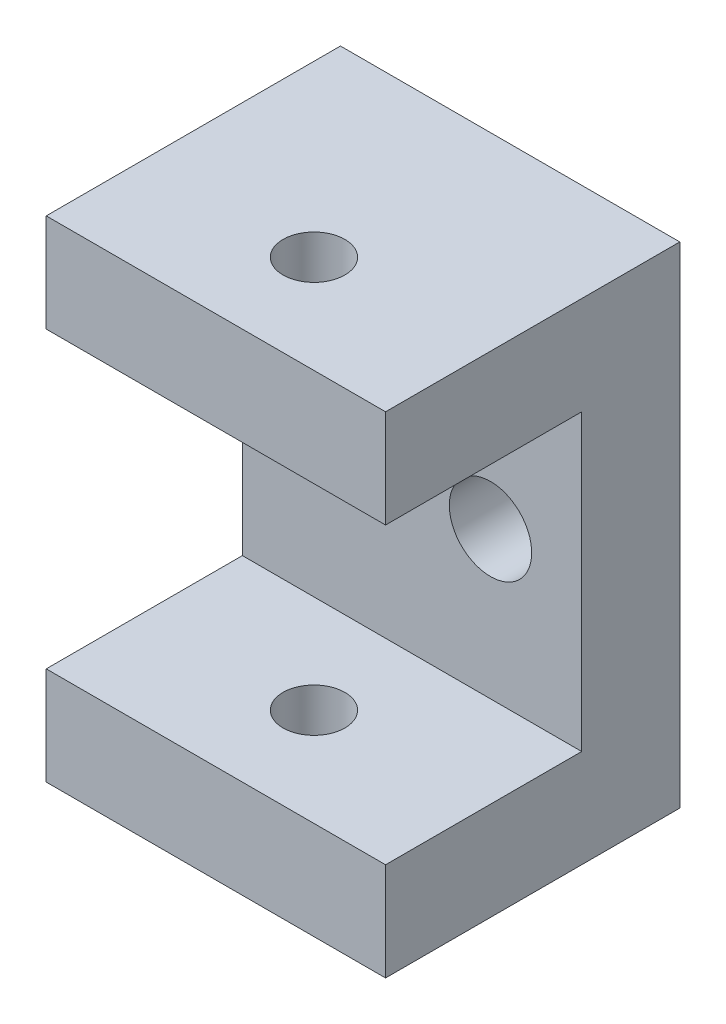
ISO-10303-21;
HEADER;
FILE_DESCRIPTION(('STEP AP214'),'2;1');
FILE_NAME('part.step','',(''),(''),'','','');
FILE_SCHEMA(('AUTOMOTIVE_DESIGN { 1 0 10303 214 1 1 1 1 }'));
ENDSEC;
DATA;
#1=APPLICATION_CONTEXT('core data for automotive mechanical design processes');
#2=APPLICATION_PROTOCOL_DEFINITION('international standard','automotive_design',2000,#1);
#3=PRODUCT_CONTEXT('',#1,'mechanical');
#4=PRODUCT('Part','Part','',(#3));
#5=PRODUCT_RELATED_PRODUCT_CATEGORY('part','',(#4));
#6=PRODUCT_DEFINITION_FORMATION('','',#4);
#7=PRODUCT_DEFINITION_CONTEXT('part definition',#1,'design');
#8=PRODUCT_DEFINITION('design','',#6,#7);
#9=PRODUCT_DEFINITION_SHAPE('','',#8);
#10=(LENGTH_UNIT() NAMED_UNIT(*) SI_UNIT(.MILLI.,.METRE.));
#11=(NAMED_UNIT(*) PLANE_ANGLE_UNIT() SI_UNIT($,.RADIAN.));
#12=(NAMED_UNIT(*) SI_UNIT($,.STERADIAN.) SOLID_ANGLE_UNIT());
#13=UNCERTAINTY_MEASURE_WITH_UNIT(LENGTH_MEASURE(1.E-05),#10,'distance_accuracy_value','');
#14=(GEOMETRIC_REPRESENTATION_CONTEXT(3) GLOBAL_UNCERTAINTY_ASSIGNED_CONTEXT((#13)) GLOBAL_UNIT_ASSIGNED_CONTEXT((#10,
#11,#12)) REPRESENTATION_CONTEXT('',''));
#15=CARTESIAN_POINT('',(0.,0.,0.));
#16=DIRECTION('',(0.,0.,1.));
#17=DIRECTION('',(1.,0.,0.));
#18=AXIS2_PLACEMENT_3D('',#15,#16,#17);
#19=CARTESIAN_POINT('',(0.,0.,30.));
#20=DIRECTION('',(0.,0.,1.));
#21=DIRECTION('',(1.,0.,0.));
#22=AXIS2_PLACEMENT_3D('',#19,#20,#21);
#23=PLANE('',#22);
#24=DIRECTION('',(-1.,0.,0.));
#25=VECTOR('',#24,1.);
#26=CARTESIAN_POINT('',(17.3,-15.,30.));
#27=LINE('',#26,#25);
#28=CARTESIAN_POINT('',(17.3,-15.,30.));
#29=VERTEX_POINT('',#28);
#30=CARTESIAN_POINT('',(-17.3,-15.,30.));
#31=VERTEX_POINT('',#30);
#32=EDGE_CURVE('E156',#29,#31,#27,.T.);
#33=ORIENTED_EDGE('',*,*,#32,.T.);
#34=DIRECTION('',(0.,-1.,0.));
#35=VECTOR('',#34,1.);
#36=CARTESIAN_POINT('',(-17.3,-25.,30.));
#37=LINE('',#36,#35);
#38=CARTESIAN_POINT('',(-17.3,-25.,30.));
#39=VERTEX_POINT('',#38);
#40=EDGE_CURVE('E90',#31,#39,#37,.T.);
#41=ORIENTED_EDGE('',*,*,#40,.T.);
#42=DIRECTION('',(1.,0.,0.));
#43=VECTOR('',#42,1.);
#44=CARTESIAN_POINT('',(17.3,-25.,30.));
#45=LINE('',#44,#43);
#46=CARTESIAN_POINT('',(17.3,-25.,30.));
#47=VERTEX_POINT('',#46);
#48=EDGE_CURVE('E133',#39,#47,#45,.T.);
#49=ORIENTED_EDGE('',*,*,#48,.T.);
#50=DIRECTION('',(0.,1.,0.));
#51=VECTOR('',#50,1.);
#52=CARTESIAN_POINT('',(17.3,-25.,30.));
#53=LINE('',#52,#51);
#54=EDGE_CURVE('E132',#47,#29,#53,.T.);
#55=ORIENTED_EDGE('',*,*,#54,.T.);
#56=EDGE_LOOP('',(#33,#41,#49,#55));
#57=FACE_BOUND('',#56,.T.);
#58=ADVANCED_FACE('F35',(#57),#23,.T.);
#59=DIRECTION('',(-1.,0.,0.));
#60=VECTOR('',#59,1.);
#61=CARTESIAN_POINT('',(17.3,15.,30.));
#62=LINE('',#61,#60);
#63=CARTESIAN_POINT('',(17.3,15.,30.));
#64=VERTEX_POINT('',#63);
#65=CARTESIAN_POINT('',(-17.3,15.,30.));
#66=VERTEX_POINT('',#65);
#67=EDGE_CURVE('E116',#64,#66,#62,.T.);
#68=ORIENTED_EDGE('',*,*,#67,.F.);
#69=CARTESIAN_POINT('',(17.3,25.,30.));
#70=VERTEX_POINT('',#69);
#71=EDGE_CURVE('E124',#64,#70,#53,.T.);
#72=ORIENTED_EDGE('',*,*,#71,.T.);
#73=DIRECTION('',(-1.,0.,0.));
#74=VECTOR('',#73,1.);
#75=CARTESIAN_POINT('',(17.3,25.,30.));
#76=LINE('',#75,#74);
#77=CARTESIAN_POINT('',(-17.3,25.,30.));
#78=VERTEX_POINT('',#77);
#79=EDGE_CURVE('E61',#70,#78,#76,.T.);
#80=ORIENTED_EDGE('',*,*,#79,.T.);
#81=EDGE_CURVE('E127',#78,#66,#37,.T.);
#82=ORIENTED_EDGE('',*,*,#81,.T.);
#83=EDGE_LOOP('',(#68,#72,#80,#82));
#84=FACE_BOUND('',#83,.T.);
#85=ADVANCED_FACE('F123',(#84),#23,.T.);
#86=CARTESIAN_POINT('',(0.,0.,0.));
#87=DIRECTION('',(0.,0.,1.));
#88=DIRECTION('',(1.,0.,0.));
#89=AXIS2_PLACEMENT_3D('',#86,#87,#88);
#90=PLANE('',#89);
#91=DIRECTION('',(0.,-1.,0.));
#92=VECTOR('',#91,1.);
#93=CARTESIAN_POINT('',(-17.3,-25.,0.));
#94=LINE('',#93,#92);
#95=CARTESIAN_POINT('',(-17.3,25.,0.));
#96=VERTEX_POINT('',#95);
#97=CARTESIAN_POINT('',(-17.3,-25.,0.));
#98=VERTEX_POINT('',#97);
#99=EDGE_CURVE('E141',#96,#98,#94,.T.);
#100=ORIENTED_EDGE('',*,*,#99,.F.);
#101=DIRECTION('',(-1.,0.,0.));
#102=VECTOR('',#101,1.);
#103=CARTESIAN_POINT('',(17.3,25.,0.));
#104=LINE('',#103,#102);
#105=CARTESIAN_POINT('',(17.3,25.,0.));
#106=VERTEX_POINT('',#105);
#107=EDGE_CURVE('E82',#106,#96,#104,.T.);
#108=ORIENTED_EDGE('',*,*,#107,.F.);
#109=DIRECTION('',(0.,1.,0.));
#110=VECTOR('',#109,1.);
#111=CARTESIAN_POINT('',(17.3,-25.,0.));
#112=LINE('',#111,#110);
#113=CARTESIAN_POINT('',(17.3,-25.,0.));
#114=VERTEX_POINT('',#113);
#115=EDGE_CURVE('E147',#114,#106,#112,.T.);
#116=ORIENTED_EDGE('',*,*,#115,.F.);
#117=DIRECTION('',(1.,0.,0.));
#118=VECTOR('',#117,1.);
#119=CARTESIAN_POINT('',(17.3,-25.,0.));
#120=LINE('',#119,#118);
#121=EDGE_CURVE('E144',#98,#114,#120,.T.);
#122=ORIENTED_EDGE('',*,*,#121,.F.);
#123=EDGE_LOOP('',(#100,#108,#116,#122));
#124=FACE_BOUND('',#123,.T.);
#125=CARTESIAN_POINT('',(-8.,0.,0.));
#126=DIRECTION('',(0.,0.,1.));
#127=DIRECTION('',(1.,0.,0.));
#128=AXIS2_PLACEMENT_3D('',#125,#126,#127);
#129=CIRCLE('',#128,4.2);
#130=CARTESIAN_POINT('',(-3.8,0.,0.));
#131=VERTEX_POINT('',#130);
#132=EDGE_CURVE('E145',#131,#131,#129,.T.);
#133=ORIENTED_EDGE('',*,*,#132,.T.);
#134=EDGE_LOOP('',(#133));
#135=FACE_BOUND('',#134,.T.);
#136=CARTESIAN_POINT('',(8.,0.,0.));
#137=DIRECTION('',(0.,0.,1.));
#138=DIRECTION('',(1.,0.,0.));
#139=AXIS2_PLACEMENT_3D('',#136,#137,#138);
#140=CIRCLE('',#139,4.2);
#141=CARTESIAN_POINT('',(12.2,0.,0.));
#142=VERTEX_POINT('',#141);
#143=EDGE_CURVE('E160',#142,#142,#140,.T.);
#144=ORIENTED_EDGE('',*,*,#143,.T.);
#145=EDGE_LOOP('',(#144));
#146=FACE_BOUND('',#145,.T.);
#147=ADVANCED_FACE('F174',(#124,#135,#146),#90,.F.);
#148=CARTESIAN_POINT('',(-17.3,-25.,30.));
#149=DIRECTION('',(1.,0.,0.));
#150=DIRECTION('',(0.,1.,0.));
#151=AXIS2_PLACEMENT_3D('',#148,#149,#150);
#152=PLANE('',#151);
#153=ORIENTED_EDGE('',*,*,#40,.F.);
#154=DIRECTION('',(0.,0.,1.));
#155=VECTOR('',#154,1.);
#156=CARTESIAN_POINT('',(-17.3,-15.,10.));
#157=LINE('',#156,#155);
#158=CARTESIAN_POINT('',(-17.3,-15.,10.));
#159=VERTEX_POINT('',#158);
#160=EDGE_CURVE('E121',#159,#31,#157,.T.);
#161=ORIENTED_EDGE('',*,*,#160,.F.);
#162=DIRECTION('',(0.,-1.,0.));
#163=VECTOR('',#162,1.);
#164=CARTESIAN_POINT('',(-17.3,15.,10.));
#165=LINE('',#164,#163);
#166=CARTESIAN_POINT('',(-17.3,15.,10.));
#167=VERTEX_POINT('',#166);
#168=EDGE_CURVE('E224',#167,#159,#165,.T.);
#169=ORIENTED_EDGE('',*,*,#168,.F.);
#170=DIRECTION('',(0.,0.,-1.));
#171=VECTOR('',#170,1.);
#172=CARTESIAN_POINT('',(-17.3,15.,10.));
#173=LINE('',#172,#171);
#174=EDGE_CURVE('E221',#66,#167,#173,.T.);
#175=ORIENTED_EDGE('',*,*,#174,.F.);
#176=ORIENTED_EDGE('',*,*,#81,.F.);
#177=DIRECTION('',(0.,0.,-1.));
#178=VECTOR('',#177,1.);
#179=CARTESIAN_POINT('',(-17.3,25.,30.));
#180=LINE('',#179,#178);
#181=EDGE_CURVE('E140',#78,#96,#180,.T.);
#182=ORIENTED_EDGE('',*,*,#181,.T.);
#183=ORIENTED_EDGE('',*,*,#99,.T.);
#184=DIRECTION('',(0.,0.,-1.));
#185=VECTOR('',#184,1.);
#186=CARTESIAN_POINT('',(-17.3,-25.,30.));
#187=LINE('',#186,#185);
#188=EDGE_CURVE('E11',#39,#98,#187,.T.);
#189=ORIENTED_EDGE('',*,*,#188,.F.);
#190=EDGE_LOOP('',(#153,#161,#169,#175,#176,#182,#183,#189));
#191=FACE_BOUND('',#190,.T.);
#192=ADVANCED_FACE('F37',(#191),#152,.F.);
#193=CARTESIAN_POINT('',(17.3,-25.,30.));
#194=DIRECTION('',(0.,1.,0.));
#195=DIRECTION('',(0.,0.,1.));
#196=AXIS2_PLACEMENT_3D('',#193,#194,#195);
#197=PLANE('',#196);
#198=CARTESIAN_POINT('',(0.,-25.,20.));
#199=DIRECTION('',(0.,1.,0.));
#200=DIRECTION('',(-1.,0.,0.));
#201=AXIS2_PLACEMENT_3D('',#198,#199,#200);
#202=CIRCLE('',#201,3.15);
#203=CARTESIAN_POINT('',(-3.15000000000001,-25.,20.));
#204=VERTEX_POINT('',#203);
#205=EDGE_CURVE('E213',#204,#204,#202,.T.);
#206=ORIENTED_EDGE('',*,*,#205,.T.);
#207=EDGE_LOOP('',(#206));
#208=FACE_BOUND('',#207,.T.);
#209=ORIENTED_EDGE('',*,*,#121,.T.);
#210=DIRECTION('',(0.,0.,-1.));
#211=VECTOR('',#210,1.);
#212=CARTESIAN_POINT('',(17.3,-25.,30.));
#213=LINE('',#212,#211);
#214=EDGE_CURVE('E44',#47,#114,#213,.T.);
#215=ORIENTED_EDGE('',*,*,#214,.F.);
#216=ORIENTED_EDGE('',*,*,#48,.F.);
#217=ORIENTED_EDGE('',*,*,#188,.T.);
#218=EDGE_LOOP('',(#209,#215,#216,#217));
#219=FACE_BOUND('',#218,.T.);
#220=ADVANCED_FACE('F203',(#208,#219),#197,.F.);
#221=CARTESIAN_POINT('',(17.3,-25.,30.));
#222=DIRECTION('',(-1.,0.,0.));
#223=DIRECTION('',(0.,0.,1.));
#224=AXIS2_PLACEMENT_3D('',#221,#222,#223);
#225=PLANE('',#224);
#226=DIRECTION('',(0.,-1.,0.));
#227=VECTOR('',#226,1.);
#228=CARTESIAN_POINT('',(17.3,15.,10.));
#229=LINE('',#228,#227);
#230=CARTESIAN_POINT('',(17.3,15.,10.));
#231=VERTEX_POINT('',#230);
#232=CARTESIAN_POINT('',(17.3,-15.,10.));
#233=VERTEX_POINT('',#232);
#234=EDGE_CURVE('E52',#231,#233,#229,.T.);
#235=ORIENTED_EDGE('',*,*,#234,.T.);
#236=DIRECTION('',(0.,0.,1.));
#237=VECTOR('',#236,1.);
#238=CARTESIAN_POINT('',(17.3,-15.,10.));
#239=LINE('',#238,#237);
#240=EDGE_CURVE('E128',#233,#29,#239,.T.);
#241=ORIENTED_EDGE('',*,*,#240,.T.);
#242=ORIENTED_EDGE('',*,*,#54,.F.);
#243=ORIENTED_EDGE('',*,*,#214,.T.);
#244=ORIENTED_EDGE('',*,*,#115,.T.);
#245=DIRECTION('',(0.,0.,-1.));
#246=VECTOR('',#245,1.);
#247=CARTESIAN_POINT('',(17.3,25.,30.));
#248=LINE('',#247,#246);
#249=EDGE_CURVE('E131',#70,#106,#248,.T.);
#250=ORIENTED_EDGE('',*,*,#249,.F.);
#251=ORIENTED_EDGE('',*,*,#71,.F.);
#252=DIRECTION('',(0.,0.,-1.));
#253=VECTOR('',#252,1.);
#254=CARTESIAN_POINT('',(17.3,15.,10.));
#255=LINE('',#254,#253);
#256=EDGE_CURVE('E112',#64,#231,#255,.T.);
#257=ORIENTED_EDGE('',*,*,#256,.T.);
#258=EDGE_LOOP('',(#235,#241,#242,#243,#244,#250,#251,#257));
#259=FACE_BOUND('',#258,.T.);
#260=ADVANCED_FACE('F130',(#259),#225,.F.);
#261=CARTESIAN_POINT('',(17.3,25.,30.));
#262=DIRECTION('',(0.,-1.,0.));
#263=DIRECTION('',(0.,0.,-1.));
#264=AXIS2_PLACEMENT_3D('',#261,#262,#263);
#265=PLANE('',#264);
#266=CARTESIAN_POINT('',(0.,25.,20.));
#267=DIRECTION('',(0.,1.,0.));
#268=DIRECTION('',(-1.,0.,0.));
#269=AXIS2_PLACEMENT_3D('',#266,#267,#268);
#270=CIRCLE('',#269,3.15);
#271=CARTESIAN_POINT('',(-3.15,25.,20.));
#272=VERTEX_POINT('',#271);
#273=EDGE_CURVE('E232',#272,#272,#270,.T.);
#274=ORIENTED_EDGE('',*,*,#273,.F.);
#275=EDGE_LOOP('',(#274));
#276=FACE_BOUND('',#275,.T.);
#277=ORIENTED_EDGE('',*,*,#107,.T.);
#278=ORIENTED_EDGE('',*,*,#181,.F.);
#279=ORIENTED_EDGE('',*,*,#79,.F.);
#280=ORIENTED_EDGE('',*,*,#249,.T.);
#281=EDGE_LOOP('',(#277,#278,#279,#280));
#282=FACE_BOUND('',#281,.T.);
#283=ADVANCED_FACE('F180',(#276,#282),#265,.F.);
#284=CARTESIAN_POINT('',(-8.,0.,30.));
#285=DIRECTION('',(0.,0.,-1.));
#286=DIRECTION('',(-1.,0.,0.));
#287=AXIS2_PLACEMENT_3D('',#284,#285,#286);
#288=CYLINDRICAL_SURFACE('',#287,4.2);
#289=CARTESIAN_POINT('',(-8.,0.,10.));
#290=DIRECTION('',(0.,0.,-1.));
#291=DIRECTION('',(-1.,0.,0.));
#292=AXIS2_PLACEMENT_3D('',#289,#290,#291);
#293=CIRCLE('',#292,4.2);
#294=CARTESIAN_POINT('',(-12.2,0.,10.));
#295=VERTEX_POINT('',#294);
#296=EDGE_CURVE('E155',#295,#295,#293,.T.);
#297=ORIENTED_EDGE('',*,*,#296,.F.);
#298=EDGE_LOOP('',(#297));
#299=FACE_BOUND('',#298,.T.);
#300=ORIENTED_EDGE('',*,*,#132,.F.);
#301=EDGE_LOOP('',(#300));
#302=FACE_BOUND('',#301,.T.);
#303=ADVANCED_FACE('F177',(#299,#302),#288,.F.);
#304=CARTESIAN_POINT('',(8.,0.,30.));
#305=DIRECTION('',(0.,0.,-1.));
#306=DIRECTION('',(-1.,0.,0.));
#307=AXIS2_PLACEMENT_3D('',#304,#305,#306);
#308=CYLINDRICAL_SURFACE('',#307,4.2);
#309=CARTESIAN_POINT('',(8.,0.,10.));
#310=DIRECTION('',(0.,0.,-1.));
#311=DIRECTION('',(-1.,0.,0.));
#312=AXIS2_PLACEMENT_3D('',#309,#310,#311);
#313=CIRCLE('',#312,4.2);
#314=CARTESIAN_POINT('',(3.8,0.,10.));
#315=VERTEX_POINT('',#314);
#316=EDGE_CURVE('E153',#315,#315,#313,.T.);
#317=ORIENTED_EDGE('',*,*,#316,.F.);
#318=EDGE_LOOP('',(#317));
#319=FACE_BOUND('',#318,.T.);
#320=ORIENTED_EDGE('',*,*,#143,.F.);
#321=EDGE_LOOP('',(#320));
#322=FACE_BOUND('',#321,.T.);
#323=ADVANCED_FACE('F179',(#319,#322),#308,.F.);
#324=CARTESIAN_POINT('',(17.3,-15.,10.));
#325=DIRECTION('',(0.,-1.,0.));
#326=DIRECTION('',(1.,0.,0.));
#327=AXIS2_PLACEMENT_3D('',#324,#325,#326);
#328=PLANE('',#327);
#329=CARTESIAN_POINT('',(0.,-15.,20.));
#330=DIRECTION('',(0.,-1.,0.));
#331=DIRECTION('',(1.,0.,0.));
#332=AXIS2_PLACEMENT_3D('',#329,#330,#331);
#333=CIRCLE('',#332,3.15);
#334=CARTESIAN_POINT('',(3.15,-15.,20.));
#335=VERTEX_POINT('',#334);
#336=EDGE_CURVE('E225',#335,#335,#333,.T.);
#337=ORIENTED_EDGE('',*,*,#336,.T.);
#338=EDGE_LOOP('',(#337));
#339=FACE_BOUND('',#338,.T.);
#340=ORIENTED_EDGE('',*,*,#160,.T.);
#341=ORIENTED_EDGE('',*,*,#32,.F.);
#342=ORIENTED_EDGE('',*,*,#240,.F.);
#343=DIRECTION('',(-1.,0.,0.));
#344=VECTOR('',#343,1.);
#345=CARTESIAN_POINT('',(17.3,-15.,10.));
#346=LINE('',#345,#344);
#347=EDGE_CURVE('E162',#233,#159,#346,.T.);
#348=ORIENTED_EDGE('',*,*,#347,.T.);
#349=EDGE_LOOP('',(#340,#341,#342,#348));
#350=FACE_BOUND('',#349,.T.);
#351=ADVANCED_FACE('F187',(#339,#350),#328,.F.);
#352=CARTESIAN_POINT('',(17.3,15.,10.));
#353=DIRECTION('',(0.,0.,-1.));
#354=DIRECTION('',(-1.,0.,0.));
#355=AXIS2_PLACEMENT_3D('',#352,#353,#354);
#356=PLANE('',#355);
#357=ORIENTED_EDGE('',*,*,#296,.T.);
#358=EDGE_LOOP('',(#357));
#359=FACE_BOUND('',#358,.T.);
#360=ORIENTED_EDGE('',*,*,#316,.T.);
#361=EDGE_LOOP('',(#360));
#362=FACE_BOUND('',#361,.T.);
#363=ORIENTED_EDGE('',*,*,#168,.T.);
#364=ORIENTED_EDGE('',*,*,#347,.F.);
#365=ORIENTED_EDGE('',*,*,#234,.F.);
#366=DIRECTION('',(-1.,0.,0.));
#367=VECTOR('',#366,1.);
#368=CARTESIAN_POINT('',(17.3,15.,10.));
#369=LINE('',#368,#367);
#370=EDGE_CURVE('E118',#231,#167,#369,.T.);
#371=ORIENTED_EDGE('',*,*,#370,.T.);
#372=EDGE_LOOP('',(#363,#364,#365,#371));
#373=FACE_BOUND('',#372,.T.);
#374=ADVANCED_FACE('F249',(#359,#362,#373),#356,.F.);
#375=CARTESIAN_POINT('',(17.3,15.,10.));
#376=DIRECTION('',(0.,1.,0.));
#377=DIRECTION('',(0.,0.,1.));
#378=AXIS2_PLACEMENT_3D('',#375,#376,#377);
#379=PLANE('',#378);
#380=CARTESIAN_POINT('',(0.,15.,20.));
#381=DIRECTION('',(0.,1.,0.));
#382=DIRECTION('',(0.,0.,1.));
#383=AXIS2_PLACEMENT_3D('',#380,#381,#382);
#384=CIRCLE('',#383,3.15);
#385=CARTESIAN_POINT('',(0.,15.,23.15));
#386=VERTEX_POINT('',#385);
#387=EDGE_CURVE('E39',#386,#386,#384,.T.);
#388=ORIENTED_EDGE('',*,*,#387,.T.);
#389=EDGE_LOOP('',(#388));
#390=FACE_BOUND('',#389,.T.);
#391=ORIENTED_EDGE('',*,*,#174,.T.);
#392=ORIENTED_EDGE('',*,*,#370,.F.);
#393=ORIENTED_EDGE('',*,*,#256,.F.);
#394=ORIENTED_EDGE('',*,*,#67,.T.);
#395=EDGE_LOOP('',(#391,#392,#393,#394));
#396=FACE_BOUND('',#395,.T.);
#397=ADVANCED_FACE('F115',(#390,#396),#379,.F.);
#398=CARTESIAN_POINT('',(0.,-25.,20.));
#399=DIRECTION('',(0.,1.,0.));
#400=DIRECTION('',(-1.,0.,0.));
#401=AXIS2_PLACEMENT_3D('',#398,#399,#400);
#402=CYLINDRICAL_SURFACE('',#401,3.15);
#403=ORIENTED_EDGE('',*,*,#273,.T.);
#404=EDGE_LOOP('',(#403));
#405=FACE_BOUND('',#404,.T.);
#406=ORIENTED_EDGE('',*,*,#387,.F.);
#407=EDGE_LOOP('',(#406));
#408=FACE_BOUND('',#407,.T.);
#409=ADVANCED_FACE('F239',(#405,#408),#402,.F.);
#410=ORIENTED_EDGE('',*,*,#205,.F.);
#411=EDGE_LOOP('',(#410));
#412=FACE_BOUND('',#411,.T.);
#413=ORIENTED_EDGE('',*,*,#336,.F.);
#414=EDGE_LOOP('',(#413));
#415=FACE_BOUND('',#414,.T.);
#416=ADVANCED_FACE('F241',(#412,#415),#402,.F.);
#417=CLOSED_SHELL('',(#58,#85,#147,#192,#220,#260,#283,#303,#323,#351,#374,#397,#409,#416));
#418=MANIFOLD_SOLID_BREP('B2',#417);
#419=ADVANCED_BREP_SHAPE_REPRESENTATION('',(#18,#418),#14);
#420=SHAPE_DEFINITION_REPRESENTATION(#9,#419);
ENDSEC;
END-ISO-10303-21;
